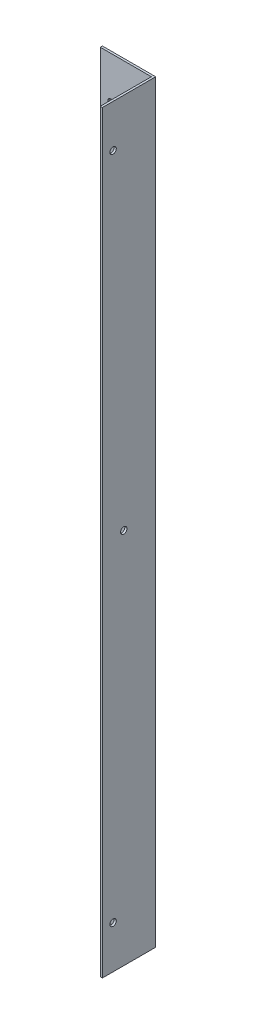
ISO-10303-21;
HEADER;
FILE_DESCRIPTION(('STEP AP214'),'2;1');
FILE_NAME('part.step','',(''),(''),'','','');
FILE_SCHEMA(('AUTOMOTIVE_DESIGN { 1 0 10303 214 1 1 1 1 }'));
ENDSEC;
DATA;
#1=APPLICATION_CONTEXT('core data for automotive mechanical design processes');
#2=APPLICATION_PROTOCOL_DEFINITION('international standard','automotive_design',2000,#1);
#3=PRODUCT_CONTEXT('',#1,'mechanical');
#4=PRODUCT('Part','Part','',(#3));
#5=PRODUCT_RELATED_PRODUCT_CATEGORY('part','',(#4));
#6=PRODUCT_DEFINITION_FORMATION('','',#4);
#7=PRODUCT_DEFINITION_CONTEXT('part definition',#1,'design');
#8=PRODUCT_DEFINITION('design','',#6,#7);
#9=PRODUCT_DEFINITION_SHAPE('','',#8);
#10=(LENGTH_UNIT() NAMED_UNIT(*) SI_UNIT(.MILLI.,.METRE.));
#11=(NAMED_UNIT(*) PLANE_ANGLE_UNIT() SI_UNIT($,.RADIAN.));
#12=(NAMED_UNIT(*) SI_UNIT($,.STERADIAN.) SOLID_ANGLE_UNIT());
#13=UNCERTAINTY_MEASURE_WITH_UNIT(LENGTH_MEASURE(1.E-05),#10,'distance_accuracy_value','');
#14=(GEOMETRIC_REPRESENTATION_CONTEXT(3) GLOBAL_UNCERTAINTY_ASSIGNED_CONTEXT((#13)) GLOBAL_UNIT_ASSIGNED_CONTEXT((#10,
#11,#12)) REPRESENTATION_CONTEXT('',''));
#15=CARTESIAN_POINT('',(0.,0.,0.));
#16=DIRECTION('',(0.,0.,1.));
#17=DIRECTION('',(1.,0.,0.));
#18=AXIS2_PLACEMENT_3D('',#15,#16,#17);
#19=CARTESIAN_POINT('',(-56.2582304015265,65.1806505786876,25.));
#20=DIRECTION('',(1.,0.,0.));
#21=DIRECTION('',(0.,1.,0.));
#22=AXIS2_PLACEMENT_3D('',#19,#20,#21);
#23=PLANE('',#22);
#24=CARTESIAN_POINT('',(-56.2582304015265,45.1806505786876,20.));
#25=DIRECTION('',(1.,0.,0.));
#26=DIRECTION('',(0.,1.,0.));
#27=AXIS2_PLACEMENT_3D('',#24,#25,#26);
#28=CIRCLE('',#27,1.5);
#29=CARTESIAN_POINT('',(-56.2582304015265,46.6806505786876,20.));
#30=VERTEX_POINT('',#29);
#31=EDGE_CURVE('E147',#30,#30,#28,.T.);
#32=ORIENTED_EDGE('',*,*,#31,.T.);
#33=EDGE_LOOP('',(#32));
#34=FACE_BOUND('',#33,.T.);
#35=CARTESIAN_POINT('',(-56.2582304015264,-268.819349421312,20.));
#36=DIRECTION('',(1.,0.,0.));
#37=DIRECTION('',(0.,1.,0.));
#38=AXIS2_PLACEMENT_3D('',#35,#36,#37);
#39=CIRCLE('',#38,1.5);
#40=CARTESIAN_POINT('',(-56.2582304015264,-267.319349421312,20.));
#41=VERTEX_POINT('',#40);
#42=EDGE_CURVE('E141',#41,#41,#39,.T.);
#43=ORIENTED_EDGE('',*,*,#42,.T.);
#44=EDGE_LOOP('',(#43));
#45=FACE_BOUND('',#44,.T.);
#46=CARTESIAN_POINT('',(-56.2582304015264,-111.819349421312,15.));
#47=DIRECTION('',(1.,0.,0.));
#48=DIRECTION('',(0.,1.,0.));
#49=AXIS2_PLACEMENT_3D('',#46,#47,#48);
#50=CIRCLE('',#49,1.5);
#51=CARTESIAN_POINT('',(-56.2582304015264,-110.319349421312,15.));
#52=VERTEX_POINT('',#51);
#53=EDGE_CURVE('E135',#52,#52,#50,.T.);
#54=ORIENTED_EDGE('',*,*,#53,.T.);
#55=EDGE_LOOP('',(#54));
#56=FACE_BOUND('',#55,.T.);
#57=DIRECTION('',(0.,1.,0.));
#58=VECTOR('',#57,1.);
#59=CARTESIAN_POINT('',(-56.2582304015265,65.1806505786876,1.));
#60=LINE('',#59,#58);
#61=CARTESIAN_POINT('',(-56.2582304015264,-288.819349421312,1.));
#62=VERTEX_POINT('',#61);
#63=CARTESIAN_POINT('',(-56.2582304015265,65.1806505786876,1.));
#64=VERTEX_POINT('',#63);
#65=EDGE_CURVE('E48',#62,#64,#60,.T.);
#66=ORIENTED_EDGE('',*,*,#65,.F.);
#67=DIRECTION('',(0.,0.,-1.));
#68=VECTOR('',#67,1.);
#69=CARTESIAN_POINT('',(-56.2582304015264,-288.819349421312,25.));
#70=LINE('',#69,#68);
#71=CARTESIAN_POINT('',(-56.2582304015264,-288.819349421312,25.));
#72=VERTEX_POINT('',#71);
#73=EDGE_CURVE('E11',#72,#62,#70,.T.);
#74=ORIENTED_EDGE('',*,*,#73,.F.);
#75=DIRECTION('',(0.,-1.,0.));
#76=VECTOR('',#75,1.);
#77=CARTESIAN_POINT('',(-56.2582304015265,65.1806505786876,25.));
#78=LINE('',#77,#76);
#79=CARTESIAN_POINT('',(-56.2582304015265,65.1806505786876,25.));
#80=VERTEX_POINT('',#79);
#81=EDGE_CURVE('E95',#80,#72,#78,.T.);
#82=ORIENTED_EDGE('',*,*,#81,.F.);
#83=DIRECTION('',(0.,0.,-1.));
#84=VECTOR('',#83,1.);
#85=CARTESIAN_POINT('',(-56.2582304015265,65.1806505786876,25.));
#86=LINE('',#85,#84);
#87=EDGE_CURVE('E94',#80,#64,#86,.T.);
#88=ORIENTED_EDGE('',*,*,#87,.T.);
#89=EDGE_LOOP('',(#66,#74,#82,#88));
#90=FACE_BOUND('',#89,.T.);
#91=ADVANCED_FACE('F32',(#34,#45,#56,#90),#23,.F.);
#92=CARTESIAN_POINT('',(-56.2582304015264,-288.819349421312,25.));
#93=DIRECTION('',(0.,1.,0.));
#94=DIRECTION('',(0.,0.,1.));
#95=AXIS2_PLACEMENT_3D('',#92,#93,#94);
#96=PLANE('',#95);
#97=DIRECTION('',(1.,0.,0.));
#98=VECTOR('',#97,1.);
#99=CARTESIAN_POINT('',(-56.2582304015264,-288.819349421312,0.));
#100=LINE('',#99,#98);
#101=CARTESIAN_POINT('',(-80.2582304015277,-288.819349421312,0.));
#102=VERTEX_POINT('',#101);
#103=CARTESIAN_POINT('',(-55.2582304015264,-288.819349421312,0.));
#104=VERTEX_POINT('',#103);
#105=EDGE_CURVE('E150',#102,#104,#100,.T.);
#106=ORIENTED_EDGE('',*,*,#105,.T.);
#107=DIRECTION('',(0.,0.,-1.));
#108=VECTOR('',#107,1.);
#109=CARTESIAN_POINT('',(-55.2582304015264,-288.819349421312,25.));
#110=LINE('',#109,#108);
#111=CARTESIAN_POINT('',(-55.2582304015264,-288.819349421312,25.));
#112=VERTEX_POINT('',#111);
#113=EDGE_CURVE('E40',#112,#104,#110,.T.);
#114=ORIENTED_EDGE('',*,*,#113,.F.);
#115=DIRECTION('',(1.,0.,0.));
#116=VECTOR('',#115,1.);
#117=CARTESIAN_POINT('',(-56.2582304015264,-288.819349421312,25.));
#118=LINE('',#117,#116);
#119=EDGE_CURVE('E79',#72,#112,#118,.T.);
#120=ORIENTED_EDGE('',*,*,#119,.F.);
#121=ORIENTED_EDGE('',*,*,#73,.T.);
#122=DIRECTION('',(1.,0.,0.));
#123=VECTOR('',#122,1.);
#124=CARTESIAN_POINT('',(-56.2582304015264,-288.819349421312,1.));
#125=LINE('',#124,#123);
#126=CARTESIAN_POINT('',(-80.2582304015277,-288.819349421312,1.));
#127=VERTEX_POINT('',#126);
#128=EDGE_CURVE('E107',#127,#62,#125,.T.);
#129=ORIENTED_EDGE('',*,*,#128,.F.);
#130=DIRECTION('',(0.,0.,-1.));
#131=VECTOR('',#130,1.);
#132=CARTESIAN_POINT('',(-80.2582304015277,-288.819349421312,1.));
#133=LINE('',#132,#131);
#134=EDGE_CURVE('E115',#127,#102,#133,.T.);
#135=ORIENTED_EDGE('',*,*,#134,.T.);
#136=EDGE_LOOP('',(#106,#114,#120,#121,#129,#135));
#137=FACE_BOUND('',#136,.T.);
#138=ADVANCED_FACE('F172',(#137),#96,.F.);
#139=CARTESIAN_POINT('',(-55.2582304015265,65.1806505786876,25.));
#140=DIRECTION('',(-1.,0.,0.));
#141=DIRECTION('',(0.,-1.,0.));
#142=AXIS2_PLACEMENT_3D('',#139,#140,#141);
#143=PLANE('',#142);
#144=CARTESIAN_POINT('',(-55.2582304015264,-111.819349421312,15.));
#145=DIRECTION('',(1.,0.,0.));
#146=DIRECTION('',(0.,1.,0.));
#147=AXIS2_PLACEMENT_3D('',#144,#145,#146);
#148=CIRCLE('',#147,1.5);
#149=CARTESIAN_POINT('',(-55.2582304015264,-110.319349421312,15.));
#150=VERTEX_POINT('',#149);
#151=EDGE_CURVE('E134',#150,#150,#148,.T.);
#152=ORIENTED_EDGE('',*,*,#151,.F.);
#153=EDGE_LOOP('',(#152));
#154=FACE_BOUND('',#153,.T.);
#155=CARTESIAN_POINT('',(-55.2582304015264,-268.819349421312,20.));
#156=DIRECTION('',(1.,0.,0.));
#157=DIRECTION('',(0.,1.,0.));
#158=AXIS2_PLACEMENT_3D('',#155,#156,#157);
#159=CIRCLE('',#158,1.5);
#160=CARTESIAN_POINT('',(-55.2582304015264,-267.319349421312,20.));
#161=VERTEX_POINT('',#160);
#162=EDGE_CURVE('E138',#161,#161,#159,.T.);
#163=ORIENTED_EDGE('',*,*,#162,.F.);
#164=EDGE_LOOP('',(#163));
#165=FACE_BOUND('',#164,.T.);
#166=CARTESIAN_POINT('',(-55.2582304015265,45.1806505786876,20.));
#167=DIRECTION('',(1.,0.,0.));
#168=DIRECTION('',(0.,1.,0.));
#169=AXIS2_PLACEMENT_3D('',#166,#167,#168);
#170=CIRCLE('',#169,1.5);
#171=CARTESIAN_POINT('',(-55.2582304015265,46.6806505786876,20.));
#172=VERTEX_POINT('',#171);
#173=EDGE_CURVE('E144',#172,#172,#170,.T.);
#174=ORIENTED_EDGE('',*,*,#173,.F.);
#175=EDGE_LOOP('',(#174));
#176=FACE_BOUND('',#175,.T.);
#177=DIRECTION('',(0.,1.,0.));
#178=VECTOR('',#177,1.);
#179=CARTESIAN_POINT('',(-55.2582304015265,65.1806505786876,0.));
#180=LINE('',#179,#178);
#181=CARTESIAN_POINT('',(-55.2582304015265,65.1806505786876,0.));
#182=VERTEX_POINT('',#181);
#183=EDGE_CURVE('E72',#104,#182,#180,.T.);
#184=ORIENTED_EDGE('',*,*,#183,.T.);
#185=DIRECTION('',(0.,0.,-1.));
#186=VECTOR('',#185,1.);
#187=CARTESIAN_POINT('',(-55.2582304015265,65.1806505786876,25.));
#188=LINE('',#187,#186);
#189=CARTESIAN_POINT('',(-55.2582304015265,65.1806505786876,25.));
#190=VERTEX_POINT('',#189);
#191=EDGE_CURVE('E98',#190,#182,#188,.T.);
#192=ORIENTED_EDGE('',*,*,#191,.F.);
#193=DIRECTION('',(0.,1.,0.));
#194=VECTOR('',#193,1.);
#195=CARTESIAN_POINT('',(-55.2582304015265,65.1806505786876,25.));
#196=LINE('',#195,#194);
#197=EDGE_CURVE('E156',#112,#190,#196,.T.);
#198=ORIENTED_EDGE('',*,*,#197,.F.);
#199=ORIENTED_EDGE('',*,*,#113,.T.);
#200=EDGE_LOOP('',(#184,#192,#198,#199));
#201=FACE_BOUND('',#200,.T.);
#202=ADVANCED_FACE('F193',(#154,#165,#176,#201),#143,.F.);
#203=CARTESIAN_POINT('',(-56.2582304015265,65.1806505786876,25.));
#204=DIRECTION('',(0.,-1.,0.));
#205=DIRECTION('',(0.,0.,-1.));
#206=AXIS2_PLACEMENT_3D('',#203,#204,#205);
#207=PLANE('',#206);
#208=DIRECTION('',(-1.,0.,0.));
#209=VECTOR('',#208,1.);
#210=CARTESIAN_POINT('',(-56.2582304015265,65.1806505786876,0.));
#211=LINE('',#210,#209);
#212=CARTESIAN_POINT('',(-80.2582304015265,65.1806505786876,0.));
#213=VERTEX_POINT('',#212);
#214=EDGE_CURVE('E154',#182,#213,#211,.T.);
#215=ORIENTED_EDGE('',*,*,#214,.T.);
#216=DIRECTION('',(0.,0.,-1.));
#217=VECTOR('',#216,1.);
#218=CARTESIAN_POINT('',(-80.2582304015265,65.1806505786876,1.));
#219=LINE('',#218,#217);
#220=CARTESIAN_POINT('',(-80.2582304015265,65.1806505786876,1.));
#221=VERTEX_POINT('',#220);
#222=EDGE_CURVE('E111',#221,#213,#219,.T.);
#223=ORIENTED_EDGE('',*,*,#222,.F.);
#224=DIRECTION('',(-1.,0.,0.));
#225=VECTOR('',#224,1.);
#226=CARTESIAN_POINT('',(-56.2582304015265,65.1806505786876,1.));
#227=LINE('',#226,#225);
#228=EDGE_CURVE('E104',#64,#221,#227,.T.);
#229=ORIENTED_EDGE('',*,*,#228,.F.);
#230=ORIENTED_EDGE('',*,*,#87,.F.);
#231=DIRECTION('',(-1.,0.,0.));
#232=VECTOR('',#231,1.);
#233=CARTESIAN_POINT('',(-56.2582304015265,65.1806505786876,25.));
#234=LINE('',#233,#232);
#235=EDGE_CURVE('E56',#190,#80,#234,.T.);
#236=ORIENTED_EDGE('',*,*,#235,.F.);
#237=ORIENTED_EDGE('',*,*,#191,.T.);
#238=EDGE_LOOP('',(#215,#223,#229,#230,#236,#237));
#239=FACE_BOUND('',#238,.T.);
#240=ADVANCED_FACE('F109',(#239),#207,.F.);
#241=CARTESIAN_POINT('',(0.,0.,25.));
#242=DIRECTION('',(0.,0.,1.));
#243=DIRECTION('',(1.,0.,0.));
#244=AXIS2_PLACEMENT_3D('',#241,#242,#243);
#245=PLANE('',#244);
#246=ORIENTED_EDGE('',*,*,#81,.T.);
#247=ORIENTED_EDGE('',*,*,#119,.T.);
#248=ORIENTED_EDGE('',*,*,#197,.T.);
#249=ORIENTED_EDGE('',*,*,#235,.T.);
#250=EDGE_LOOP('',(#246,#247,#248,#249));
#251=FACE_BOUND('',#250,.T.);
#252=ADVANCED_FACE('F222',(#251),#245,.T.);
#253=CARTESIAN_POINT('',(0.,0.,0.));
#254=DIRECTION('',(0.,0.,1.));
#255=DIRECTION('',(1.,0.,0.));
#256=AXIS2_PLACEMENT_3D('',#253,#254,#255);
#257=PLANE('',#256);
#258=ORIENTED_EDGE('',*,*,#105,.F.);
#259=DIRECTION('',(0.,-1.,0.));
#260=VECTOR('',#259,1.);
#261=CARTESIAN_POINT('',(-80.2582304015265,65.1806505786876,0.));
#262=LINE('',#261,#260);
#263=EDGE_CURVE('E120',#213,#102,#262,.T.);
#264=ORIENTED_EDGE('',*,*,#263,.F.);
#265=ORIENTED_EDGE('',*,*,#214,.F.);
#266=ORIENTED_EDGE('',*,*,#183,.F.);
#267=EDGE_LOOP('',(#258,#264,#265,#266));
#268=FACE_BOUND('',#267,.T.);
#269=CARTESIAN_POINT('',(-75.2582304015265,45.1806505786876,0.));
#270=DIRECTION('',(0.,0.,1.));
#271=DIRECTION('',(1.,0.,0.));
#272=AXIS2_PLACEMENT_3D('',#269,#270,#271);
#273=CIRCLE('',#272,1.5);
#274=CARTESIAN_POINT('',(-73.7582304015265,45.1806505786876,0.));
#275=VERTEX_POINT('',#274);
#276=EDGE_CURVE('E129',#275,#275,#273,.T.);
#277=ORIENTED_EDGE('',*,*,#276,.T.);
#278=EDGE_LOOP('',(#277));
#279=FACE_BOUND('',#278,.T.);
#280=CARTESIAN_POINT('',(-75.2582304015276,-268.819349421312,0.));
#281=DIRECTION('',(0.,0.,1.));
#282=DIRECTION('',(1.,0.,0.));
#283=AXIS2_PLACEMENT_3D('',#280,#281,#282);
#284=CIRCLE('',#283,1.5);
#285=CARTESIAN_POINT('',(-73.7582304015276,-268.819349421312,0.));
#286=VERTEX_POINT('',#285);
#287=EDGE_CURVE('E277',#286,#286,#284,.T.);
#288=ORIENTED_EDGE('',*,*,#287,.T.);
#289=EDGE_LOOP('',(#288));
#290=FACE_BOUND('',#289,.T.);
#291=ADVANCED_FACE('F170',(#268,#279,#290),#257,.F.);
#292=CARTESIAN_POINT('',(-56.2582304015265,45.1806505786876,20.));
#293=DIRECTION('',(1.,0.,0.));
#294=DIRECTION('',(0.,1.,0.));
#295=AXIS2_PLACEMENT_3D('',#292,#293,#294);
#296=CYLINDRICAL_SURFACE('',#295,1.5);
#297=ORIENTED_EDGE('',*,*,#31,.F.);
#298=EDGE_LOOP('',(#297));
#299=FACE_BOUND('',#298,.T.);
#300=ORIENTED_EDGE('',*,*,#173,.T.);
#301=EDGE_LOOP('',(#300));
#302=FACE_BOUND('',#301,.T.);
#303=ADVANCED_FACE('F212',(#299,#302),#296,.F.);
#304=CARTESIAN_POINT('',(-56.2582304015264,-268.819349421312,20.));
#305=DIRECTION('',(1.,0.,0.));
#306=DIRECTION('',(0.,1.,0.));
#307=AXIS2_PLACEMENT_3D('',#304,#305,#306);
#308=CYLINDRICAL_SURFACE('',#307,1.5);
#309=ORIENTED_EDGE('',*,*,#42,.F.);
#310=EDGE_LOOP('',(#309));
#311=FACE_BOUND('',#310,.T.);
#312=ORIENTED_EDGE('',*,*,#162,.T.);
#313=EDGE_LOOP('',(#312));
#314=FACE_BOUND('',#313,.T.);
#315=ADVANCED_FACE('F202',(#311,#314),#308,.F.);
#316=CARTESIAN_POINT('',(-56.2582304015264,-111.819349421312,15.));
#317=DIRECTION('',(1.,0.,0.));
#318=DIRECTION('',(0.,1.,0.));
#319=AXIS2_PLACEMENT_3D('',#316,#317,#318);
#320=CYLINDRICAL_SURFACE('',#319,1.5);
#321=ORIENTED_EDGE('',*,*,#53,.F.);
#322=EDGE_LOOP('',(#321));
#323=FACE_BOUND('',#322,.T.);
#324=ORIENTED_EDGE('',*,*,#151,.T.);
#325=EDGE_LOOP('',(#324));
#326=FACE_BOUND('',#325,.T.);
#327=ADVANCED_FACE('F184',(#323,#326),#320,.F.);
#328=CARTESIAN_POINT('',(0.,0.,1.));
#329=DIRECTION('',(0.,0.,1.));
#330=DIRECTION('',(1.,0.,0.));
#331=AXIS2_PLACEMENT_3D('',#328,#329,#330);
#332=PLANE('',#331);
#333=CARTESIAN_POINT('',(-75.2582304015265,45.1806505786876,1.));
#334=DIRECTION('',(0.,0.,1.));
#335=DIRECTION('',(1.,0.,0.));
#336=AXIS2_PLACEMENT_3D('',#333,#334,#335);
#337=CIRCLE('',#336,1.5);
#338=CARTESIAN_POINT('',(-73.7582304015265,45.1806505786876,1.));
#339=VERTEX_POINT('',#338);
#340=EDGE_CURVE('E122',#339,#339,#337,.T.);
#341=ORIENTED_EDGE('',*,*,#340,.F.);
#342=EDGE_LOOP('',(#341));
#343=FACE_BOUND('',#342,.T.);
#344=ORIENTED_EDGE('',*,*,#128,.T.);
#345=ORIENTED_EDGE('',*,*,#65,.T.);
#346=ORIENTED_EDGE('',*,*,#228,.T.);
#347=DIRECTION('',(0.,-1.,0.));
#348=VECTOR('',#347,1.);
#349=CARTESIAN_POINT('',(-80.2582304015265,65.1806505786876,1.));
#350=LINE('',#349,#348);
#351=EDGE_CURVE('E113',#221,#127,#350,.T.);
#352=ORIENTED_EDGE('',*,*,#351,.T.);
#353=EDGE_LOOP('',(#344,#345,#346,#352));
#354=FACE_BOUND('',#353,.T.);
#355=CARTESIAN_POINT('',(-75.2582304015276,-268.819349421312,1.));
#356=DIRECTION('',(0.,0.,1.));
#357=DIRECTION('',(1.,0.,0.));
#358=AXIS2_PLACEMENT_3D('',#355,#356,#357);
#359=CIRCLE('',#358,1.5);
#360=CARTESIAN_POINT('',(-73.7582304015276,-268.819349421312,1.));
#361=VERTEX_POINT('',#360);
#362=EDGE_CURVE('E274',#361,#361,#359,.T.);
#363=ORIENTED_EDGE('',*,*,#362,.F.);
#364=EDGE_LOOP('',(#363));
#365=FACE_BOUND('',#364,.T.);
#366=ADVANCED_FACE('F102',(#343,#354,#365),#332,.T.);
#367=CARTESIAN_POINT('',(-80.2582304015265,65.1806505786876,1.));
#368=DIRECTION('',(1.,0.,0.));
#369=DIRECTION('',(0.,1.,0.));
#370=AXIS2_PLACEMENT_3D('',#367,#368,#369);
#371=PLANE('',#370);
#372=ORIENTED_EDGE('',*,*,#263,.T.);
#373=ORIENTED_EDGE('',*,*,#134,.F.);
#374=ORIENTED_EDGE('',*,*,#351,.F.);
#375=ORIENTED_EDGE('',*,*,#222,.T.);
#376=EDGE_LOOP('',(#372,#373,#374,#375));
#377=FACE_BOUND('',#376,.T.);
#378=ADVANCED_FACE('F173',(#377),#371,.F.);
#379=CARTESIAN_POINT('',(-75.2582304015265,45.1806505786876,1.));
#380=DIRECTION('',(0.,0.,-1.));
#381=DIRECTION('',(-1.,0.,0.));
#382=AXIS2_PLACEMENT_3D('',#379,#380,#381);
#383=CYLINDRICAL_SURFACE('',#382,1.5);
#384=ORIENTED_EDGE('',*,*,#340,.T.);
#385=EDGE_LOOP('',(#384));
#386=FACE_BOUND('',#385,.T.);
#387=ORIENTED_EDGE('',*,*,#276,.F.);
#388=EDGE_LOOP('',(#387));
#389=FACE_BOUND('',#388,.T.);
#390=ADVANCED_FACE('F175',(#386,#389),#383,.F.);
#391=CARTESIAN_POINT('',(-75.2582304015276,-268.819349421312,1.));
#392=DIRECTION('',(0.,0.,-1.));
#393=DIRECTION('',(-1.,0.,0.));
#394=AXIS2_PLACEMENT_3D('',#391,#392,#393);
#395=CYLINDRICAL_SURFACE('',#394,1.5);
#396=ORIENTED_EDGE('',*,*,#362,.T.);
#397=EDGE_LOOP('',(#396));
#398=FACE_BOUND('',#397,.T.);
#399=ORIENTED_EDGE('',*,*,#287,.F.);
#400=EDGE_LOOP('',(#399));
#401=FACE_BOUND('',#400,.T.);
#402=ADVANCED_FACE('F181',(#398,#401),#395,.F.);
#403=CLOSED_SHELL('',(#91,#138,#202,#240,#252,#291,#303,#315,#327,#366,#378,#390,#402));
#404=MANIFOLD_SOLID_BREP('B2',#403);
#405=ADVANCED_BREP_SHAPE_REPRESENTATION('',(#18,#404),#14);
#406=SHAPE_DEFINITION_REPRESENTATION(#9,#405);
ENDSEC;
END-ISO-10303-21;
